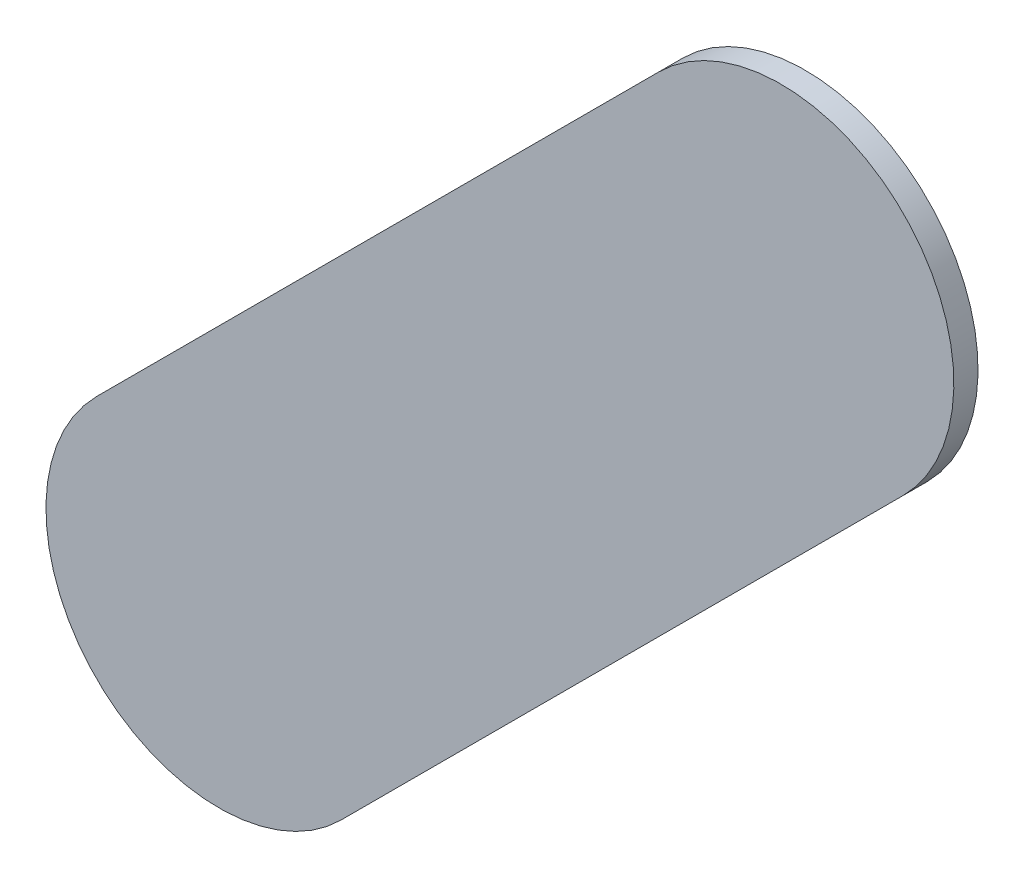
ISO-10303-21;
HEADER;
FILE_DESCRIPTION(('STEP AP214'),'2;1');
FILE_NAME('part.step','',(''),(''),'','','');
FILE_SCHEMA(('AUTOMOTIVE_DESIGN { 1 0 10303 214 1 1 1 1 }'));
ENDSEC;
DATA;
#1=APPLICATION_CONTEXT('core data for automotive mechanical design processes');
#2=APPLICATION_PROTOCOL_DEFINITION('international standard','automotive_design',2000,#1);
#3=PRODUCT_CONTEXT('',#1,'mechanical');
#4=PRODUCT('Part','Part','',(#3));
#5=PRODUCT_RELATED_PRODUCT_CATEGORY('part','',(#4));
#6=PRODUCT_DEFINITION_FORMATION('','',#4);
#7=PRODUCT_DEFINITION_CONTEXT('part definition',#1,'design');
#8=PRODUCT_DEFINITION('design','',#6,#7);
#9=PRODUCT_DEFINITION_SHAPE('','',#8);
#10=(LENGTH_UNIT() NAMED_UNIT(*) SI_UNIT(.MILLI.,.METRE.));
#11=(NAMED_UNIT(*) PLANE_ANGLE_UNIT() SI_UNIT($,.RADIAN.));
#12=(NAMED_UNIT(*) SI_UNIT($,.STERADIAN.) SOLID_ANGLE_UNIT());
#13=UNCERTAINTY_MEASURE_WITH_UNIT(LENGTH_MEASURE(1.E-05),#10,'distance_accuracy_value','');
#14=(GEOMETRIC_REPRESENTATION_CONTEXT(3) GLOBAL_UNCERTAINTY_ASSIGNED_CONTEXT((#13)) GLOBAL_UNIT_ASSIGNED_CONTEXT((#10,
#11,#12)) REPRESENTATION_CONTEXT('',''));
#15=CARTESIAN_POINT('',(0.,0.,0.));
#16=DIRECTION('',(0.,0.,1.));
#17=DIRECTION('',(1.,0.,0.));
#18=AXIS2_PLACEMENT_3D('',#15,#16,#17);
#19=CARTESIAN_POINT('',(143.587223,-74.194423,0.));
#20=DIRECTION('',(0.,0.,1.));
#21=DIRECTION('',(1.,0.,0.));
#22=AXIS2_PLACEMENT_3D('',#19,#20,#21);
#23=PLANE('',#22);
#24=DIRECTION('',(-0.707106781186548,-0.707106781186548,0.));
#25=VECTOR('',#24,1.);
#26=CARTESIAN_POINT('',(143.587223,-74.194423,0.));
#27=LINE('',#26,#25);
#28=CARTESIAN_POINT('',(143.587223,-74.194423,0.));
#29=VERTEX_POINT('',#28);
#30=CARTESIAN_POINT('',(142.774423,-75.007223,0.));
#31=VERTEX_POINT('',#30);
#32=EDGE_CURVE('E93',#29,#31,#27,.T.);
#33=ORIENTED_EDGE('',*,*,#32,.T.);
#34=CARTESIAN_POINT('',(142.9511995,-75.1839995,0.));
#35=DIRECTION('',(0.,0.,1.));
#36=DIRECTION('',(-0.707106781186548,0.707106781186548,0.));
#37=AXIS2_PLACEMENT_3D('',#34,#35,#36);
#38=CIRCLE('',#37,0.249999723809);
#39=CARTESIAN_POINT('',(143.127976,-75.360776,0.));
#40=VERTEX_POINT('',#39);
#41=EDGE_CURVE('E76',#31,#40,#38,.T.);
#42=ORIENTED_EDGE('',*,*,#41,.T.);
#43=DIRECTION('',(0.707106781186548,0.707106781186548,0.));
#44=VECTOR('',#43,1.);
#45=CARTESIAN_POINT('',(143.127976,-75.360776,0.));
#46=LINE('',#45,#44);
#47=CARTESIAN_POINT('',(143.940776,-74.547976,0.));
#48=VERTEX_POINT('',#47);
#49=EDGE_CURVE('E20',#40,#48,#46,.T.);
#50=ORIENTED_EDGE('',*,*,#49,.T.);
#51=CARTESIAN_POINT('',(143.7639995,-74.3711995,0.));
#52=DIRECTION('',(0.,0.,1.));
#53=DIRECTION('',(0.707106781186548,-0.707106781186548,0.));
#54=AXIS2_PLACEMENT_3D('',#51,#52,#53);
#55=CIRCLE('',#54,0.249999723809);
#56=EDGE_CURVE('E11',#48,#29,#55,.T.);
#57=ORIENTED_EDGE('',*,*,#56,.T.);
#58=EDGE_LOOP('',(#33,#42,#50,#57));
#59=FACE_BOUND('',#58,.T.);
#60=ADVANCED_FACE('F17',(#59),#23,.T.);
#61=CARTESIAN_POINT('',(143.587223,-74.194423,-0.035));
#62=DIRECTION('',(0.,0.,1.));
#63=DIRECTION('',(1.,0.,0.));
#64=AXIS2_PLACEMENT_3D('',#61,#62,#63);
#65=PLANE('',#64);
#66=CARTESIAN_POINT('',(143.7639995,-74.3711995,-0.035));
#67=DIRECTION('',(0.,0.,1.));
#68=DIRECTION('',(0.707106781186548,-0.707106781186548,0.));
#69=AXIS2_PLACEMENT_3D('',#66,#67,#68);
#70=CIRCLE('',#69,0.249999723809);
#71=CARTESIAN_POINT('',(143.940776,-74.547976,-0.035));
#72=VERTEX_POINT('',#71);
#73=CARTESIAN_POINT('',(143.587223,-74.194423,-0.035));
#74=VERTEX_POINT('',#73);
#75=EDGE_CURVE('E26',#72,#74,#70,.T.);
#76=ORIENTED_EDGE('',*,*,#75,.F.);
#77=DIRECTION('',(0.707106781186548,0.707106781186548,0.));
#78=VECTOR('',#77,1.);
#79=CARTESIAN_POINT('',(143.127976,-75.360776,-0.035));
#80=LINE('',#79,#78);
#81=CARTESIAN_POINT('',(143.127976,-75.360776,-0.035));
#82=VERTEX_POINT('',#81);
#83=EDGE_CURVE('E59',#82,#72,#80,.T.);
#84=ORIENTED_EDGE('',*,*,#83,.F.);
#85=CARTESIAN_POINT('',(142.9511995,-75.1839995,-0.035));
#86=DIRECTION('',(0.,0.,1.));
#87=DIRECTION('',(-0.707106781186548,0.707106781186548,0.));
#88=AXIS2_PLACEMENT_3D('',#85,#86,#87);
#89=CIRCLE('',#88,0.249999723809);
#90=CARTESIAN_POINT('',(142.774423,-75.007223,-0.035));
#91=VERTEX_POINT('',#90);
#92=EDGE_CURVE('E95',#91,#82,#89,.T.);
#93=ORIENTED_EDGE('',*,*,#92,.F.);
#94=DIRECTION('',(-0.707106781186548,-0.707106781186548,0.));
#95=VECTOR('',#94,1.);
#96=CARTESIAN_POINT('',(143.587223,-74.194423,-0.035));
#97=LINE('',#96,#95);
#98=EDGE_CURVE('E92',#74,#91,#97,.T.);
#99=ORIENTED_EDGE('',*,*,#98,.F.);
#100=EDGE_LOOP('',(#76,#84,#93,#99));
#101=FACE_BOUND('',#100,.T.);
#102=ADVANCED_FACE('F97',(#101),#65,.F.);
#103=CARTESIAN_POINT('',(143.7639995,-74.3711995,-0.035));
#104=DIRECTION('',(0.,0.,-1.));
#105=DIRECTION('',(0.707106781186548,-0.707106781186548,0.));
#106=AXIS2_PLACEMENT_3D('',#103,#104,#105);
#107=CYLINDRICAL_SURFACE('',#106,0.249999723809);
#108=ORIENTED_EDGE('',*,*,#75,.T.);
#109=DIRECTION('',(0.,0.,1.));
#110=VECTOR('',#109,1.);
#111=CARTESIAN_POINT('',(143.587223,-74.194423,-0.035));
#112=LINE('',#111,#110);
#113=EDGE_CURVE('E82',#74,#29,#112,.T.);
#114=ORIENTED_EDGE('',*,*,#113,.T.);
#115=ORIENTED_EDGE('',*,*,#56,.F.);
#116=DIRECTION('',(0.,0.,1.));
#117=VECTOR('',#116,1.);
#118=CARTESIAN_POINT('',(143.940776,-74.547976,-0.035));
#119=LINE('',#118,#117);
#120=EDGE_CURVE('E85',#72,#48,#119,.T.);
#121=ORIENTED_EDGE('',*,*,#120,.F.);
#122=EDGE_LOOP('',(#108,#114,#115,#121));
#123=FACE_BOUND('',#122,.T.);
#124=ADVANCED_FACE('F81',(#123),#107,.T.);
#125=CARTESIAN_POINT('',(143.127976,-75.360776,-0.035));
#126=DIRECTION('',(-0.707106781186548,0.707106781186548,0.));
#127=DIRECTION('',(0.,0.,1.));
#128=AXIS2_PLACEMENT_3D('',#125,#126,#127);
#129=PLANE('',#128);
#130=ORIENTED_EDGE('',*,*,#83,.T.);
#131=ORIENTED_EDGE('',*,*,#120,.T.);
#132=ORIENTED_EDGE('',*,*,#49,.F.);
#133=DIRECTION('',(0.,0.,1.));
#134=VECTOR('',#133,1.);
#135=CARTESIAN_POINT('',(143.127976,-75.360776,-0.035));
#136=LINE('',#135,#134);
#137=EDGE_CURVE('E112',#82,#40,#136,.T.);
#138=ORIENTED_EDGE('',*,*,#137,.F.);
#139=EDGE_LOOP('',(#130,#131,#132,#138));
#140=FACE_BOUND('',#139,.T.);
#141=ADVANCED_FACE('F125',(#140),#129,.F.);
#142=CARTESIAN_POINT('',(142.9511995,-75.1839995,-0.035));
#143=DIRECTION('',(0.,0.,-1.));
#144=DIRECTION('',(-0.707106781186548,0.707106781186548,0.));
#145=AXIS2_PLACEMENT_3D('',#142,#143,#144);
#146=CYLINDRICAL_SURFACE('',#145,0.249999723809);
#147=ORIENTED_EDGE('',*,*,#92,.T.);
#148=ORIENTED_EDGE('',*,*,#137,.T.);
#149=ORIENTED_EDGE('',*,*,#41,.F.);
#150=DIRECTION('',(0.,0.,1.));
#151=VECTOR('',#150,1.);
#152=CARTESIAN_POINT('',(142.774423,-75.007223,-0.035));
#153=LINE('',#152,#151);
#154=EDGE_CURVE('E100',#91,#31,#153,.T.);
#155=ORIENTED_EDGE('',*,*,#154,.F.);
#156=EDGE_LOOP('',(#147,#148,#149,#155));
#157=FACE_BOUND('',#156,.T.);
#158=ADVANCED_FACE('F126',(#157),#146,.T.);
#159=CARTESIAN_POINT('',(143.587223,-74.194423,-0.035));
#160=DIRECTION('',(0.707106781186548,-0.707106781186548,0.));
#161=DIRECTION('',(0.,0.,-1.));
#162=AXIS2_PLACEMENT_3D('',#159,#160,#161);
#163=PLANE('',#162);
#164=ORIENTED_EDGE('',*,*,#98,.T.);
#165=ORIENTED_EDGE('',*,*,#154,.T.);
#166=ORIENTED_EDGE('',*,*,#32,.F.);
#167=ORIENTED_EDGE('',*,*,#113,.F.);
#168=EDGE_LOOP('',(#164,#165,#166,#167));
#169=FACE_BOUND('',#168,.T.);
#170=ADVANCED_FACE('F90',(#169),#163,.F.);
#171=CLOSED_SHELL('',(#60,#102,#124,#141,#158,#170));
#172=MANIFOLD_SOLID_BREP('B1',#171);
#173=ADVANCED_BREP_SHAPE_REPRESENTATION('',(#18,#172),#14);
#174=SHAPE_DEFINITION_REPRESENTATION(#9,#173);
ENDSEC;
END-ISO-10303-21;
